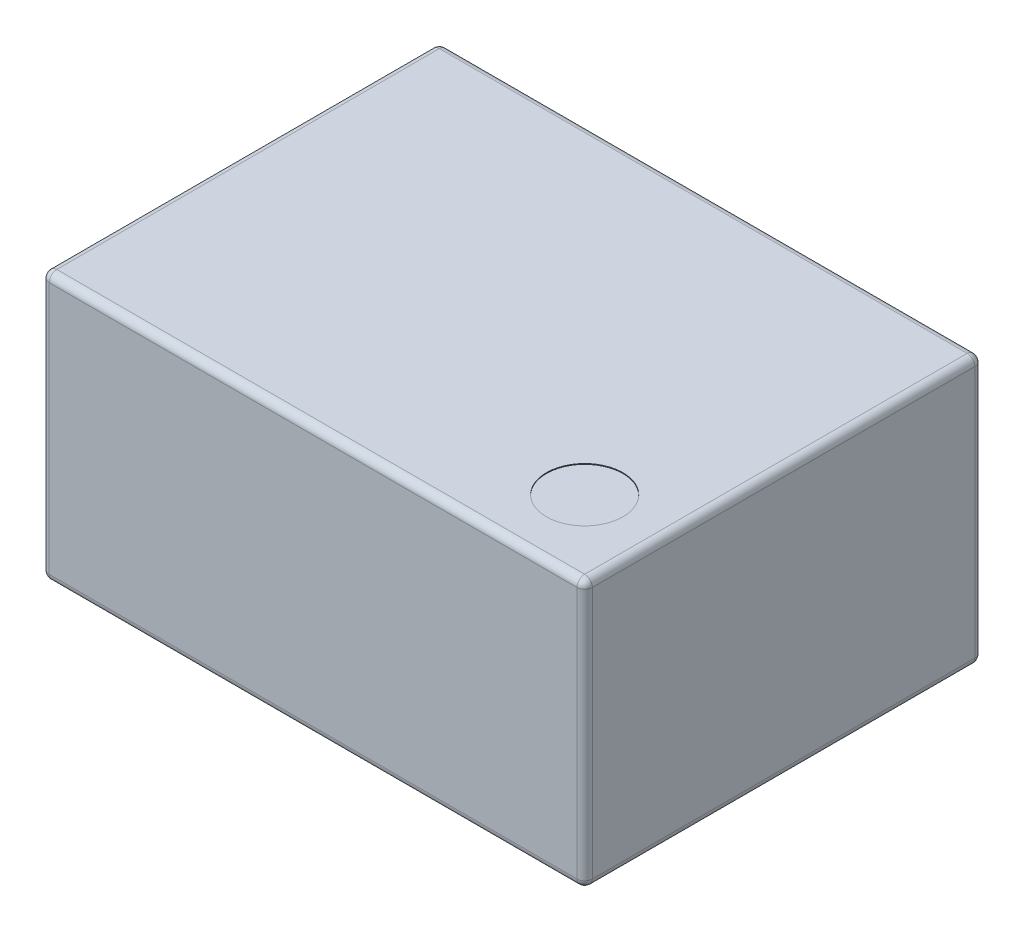
ISO-10303-21;
HEADER;
FILE_DESCRIPTION(('STEP AP214'),'2;1');
FILE_NAME('part.step','',(''),(''),'','','');
FILE_SCHEMA(('AUTOMOTIVE_DESIGN { 1 0 10303 214 1 1 1 1 }'));
ENDSEC;
DATA;
#1=APPLICATION_CONTEXT('core data for automotive mechanical design processes');
#2=APPLICATION_PROTOCOL_DEFINITION('international standard','automotive_design',2000,#1);
#3=PRODUCT_CONTEXT('',#1,'mechanical');
#4=PRODUCT('Part','Part','',(#3));
#5=PRODUCT_RELATED_PRODUCT_CATEGORY('part','',(#4));
#6=PRODUCT_DEFINITION_FORMATION('','',#4);
#7=PRODUCT_DEFINITION_CONTEXT('part definition',#1,'design');
#8=PRODUCT_DEFINITION('design','',#6,#7);
#9=PRODUCT_DEFINITION_SHAPE('','',#8);
#10=(LENGTH_UNIT() NAMED_UNIT(*) SI_UNIT(.MILLI.,.METRE.));
#11=(NAMED_UNIT(*) PLANE_ANGLE_UNIT() SI_UNIT($,.RADIAN.));
#12=(NAMED_UNIT(*) SI_UNIT($,.STERADIAN.) SOLID_ANGLE_UNIT());
#13=UNCERTAINTY_MEASURE_WITH_UNIT(LENGTH_MEASURE(1.E-05),#10,'distance_accuracy_value','');
#14=(GEOMETRIC_REPRESENTATION_CONTEXT(3) GLOBAL_UNCERTAINTY_ASSIGNED_CONTEXT((#13)) GLOBAL_UNIT_ASSIGNED_CONTEXT((#10,
#11,#12)) REPRESENTATION_CONTEXT('',''));
#15=CARTESIAN_POINT('',(0.,0.,0.));
#16=DIRECTION('',(0.,0.,1.));
#17=DIRECTION('',(1.,0.,0.));
#18=AXIS2_PLACEMENT_3D('',#15,#16,#17);
#19=CARTESIAN_POINT('',(3.55,3.5,-2.6));
#20=DIRECTION('',(-1.,0.,0.));
#21=DIRECTION('',(0.,0.,1.));
#22=AXIS2_PLACEMENT_3D('',#19,#20,#21);
#23=PLANE('',#22);
#24=DIRECTION('',(0.,-1.,0.));
#25=VECTOR('',#24,1.);
#26=CARTESIAN_POINT('',(3.55,3.5,2.5));
#27=LINE('',#26,#25);
#28=CARTESIAN_POINT('',(3.55,3.4,2.5));
#29=VERTEX_POINT('',#28);
#30=CARTESIAN_POINT('',(3.55,0.0999999999999998,2.5));
#31=VERTEX_POINT('',#30);
#32=EDGE_CURVE('E214',#29,#31,#27,.T.);
#33=ORIENTED_EDGE('',*,*,#32,.T.);
#34=DIRECTION('',(0.,0.,-1.));
#35=VECTOR('',#34,1.);
#36=CARTESIAN_POINT('',(3.55,0.0999999999999998,-2.6));
#37=LINE('',#36,#35);
#38=CARTESIAN_POINT('',(3.55,0.0999999999999998,-2.5));
#39=VERTEX_POINT('',#38);
#40=EDGE_CURVE('E223',#31,#39,#37,.T.);
#41=ORIENTED_EDGE('',*,*,#40,.T.);
#42=DIRECTION('',(0.,-1.,0.));
#43=VECTOR('',#42,1.);
#44=CARTESIAN_POINT('',(3.55,3.5,-2.5));
#45=LINE('',#44,#43);
#46=CARTESIAN_POINT('',(3.55,3.4,-2.5));
#47=VERTEX_POINT('',#46);
#48=EDGE_CURVE('E220',#39,#47,#45,.F.);
#49=ORIENTED_EDGE('',*,*,#48,.T.);
#50=DIRECTION('',(0.,0.,-1.));
#51=VECTOR('',#50,1.);
#52=CARTESIAN_POINT('',(3.55,3.4,2.6));
#53=LINE('',#52,#51);
#54=EDGE_CURVE('E217',#47,#29,#53,.F.);
#55=ORIENTED_EDGE('',*,*,#54,.T.);
#56=EDGE_LOOP('',(#33,#41,#49,#55));
#57=FACE_BOUND('',#56,.T.);
#58=ADVANCED_FACE('F40',(#57),#23,.F.);
#59=CARTESIAN_POINT('',(-3.55,3.5,-2.6));
#60=DIRECTION('',(0.,0.,1.));
#61=DIRECTION('',(1.,0.,0.));
#62=AXIS2_PLACEMENT_3D('',#59,#60,#61);
#63=PLANE('',#62);
#64=DIRECTION('',(0.,-1.,0.));
#65=VECTOR('',#64,1.);
#66=CARTESIAN_POINT('',(3.45,3.5,-2.6));
#67=LINE('',#66,#65);
#68=CARTESIAN_POINT('',(3.45,3.4,-2.6));
#69=VERTEX_POINT('',#68);
#70=CARTESIAN_POINT('',(3.45,0.0999999999999998,-2.6));
#71=VERTEX_POINT('',#70);
#72=EDGE_CURVE('E169',#69,#71,#67,.T.);
#73=ORIENTED_EDGE('',*,*,#72,.T.);
#74=DIRECTION('',(-1.,0.,0.));
#75=VECTOR('',#74,1.);
#76=CARTESIAN_POINT('',(-3.55,0.0999999999999998,-2.6));
#77=LINE('',#76,#75);
#78=CARTESIAN_POINT('',(-3.45,0.0999999999999998,-2.6));
#79=VERTEX_POINT('',#78);
#80=EDGE_CURVE('E138',#71,#79,#77,.T.);
#81=ORIENTED_EDGE('',*,*,#80,.T.);
#82=DIRECTION('',(0.,-1.,0.));
#83=VECTOR('',#82,1.);
#84=CARTESIAN_POINT('',(-3.45,3.5,-2.6));
#85=LINE('',#84,#83);
#86=CARTESIAN_POINT('',(-3.45,3.4,-2.6));
#87=VERTEX_POINT('',#86);
#88=EDGE_CURVE('E159',#79,#87,#85,.F.);
#89=ORIENTED_EDGE('',*,*,#88,.T.);
#90=DIRECTION('',(-1.,0.,0.));
#91=VECTOR('',#90,1.);
#92=CARTESIAN_POINT('',(3.55,3.4,-2.6));
#93=LINE('',#92,#91);
#94=EDGE_CURVE('E165',#87,#69,#93,.F.);
#95=ORIENTED_EDGE('',*,*,#94,.T.);
#96=EDGE_LOOP('',(#73,#81,#89,#95));
#97=FACE_BOUND('',#96,.T.);
#98=ADVANCED_FACE('F167',(#97),#63,.F.);
#99=CARTESIAN_POINT('',(-3.55,3.5,-2.6));
#100=DIRECTION('',(1.,0.,0.));
#101=DIRECTION('',(0.,0.,-1.));
#102=AXIS2_PLACEMENT_3D('',#99,#100,#101);
#103=PLANE('',#102);
#104=DIRECTION('',(0.,-1.,0.));
#105=VECTOR('',#104,1.);
#106=CARTESIAN_POINT('',(-3.55,3.5,-2.5));
#107=LINE('',#106,#105);
#108=CARTESIAN_POINT('',(-3.55,3.4,-2.5));
#109=VERTEX_POINT('',#108);
#110=CARTESIAN_POINT('',(-3.55,0.0999999999999998,-2.5));
#111=VERTEX_POINT('',#110);
#112=EDGE_CURVE('E191',#109,#111,#107,.T.);
#113=ORIENTED_EDGE('',*,*,#112,.T.);
#114=DIRECTION('',(0.,0.,1.));
#115=VECTOR('',#114,1.);
#116=CARTESIAN_POINT('',(-3.55,0.0999999999999998,-2.6));
#117=LINE('',#116,#115);
#118=CARTESIAN_POINT('',(-3.55,0.0999999999999998,2.5));
#119=VERTEX_POINT('',#118);
#120=EDGE_CURVE('E197',#111,#119,#117,.T.);
#121=ORIENTED_EDGE('',*,*,#120,.T.);
#122=DIRECTION('',(0.,-1.,0.));
#123=VECTOR('',#122,1.);
#124=CARTESIAN_POINT('',(-3.55,3.5,2.5));
#125=LINE('',#124,#123);
#126=CARTESIAN_POINT('',(-3.55,3.4,2.5));
#127=VERTEX_POINT('',#126);
#128=EDGE_CURVE('E194',#119,#127,#125,.F.);
#129=ORIENTED_EDGE('',*,*,#128,.T.);
#130=DIRECTION('',(0.,0.,1.));
#131=VECTOR('',#130,1.);
#132=CARTESIAN_POINT('',(-3.55,3.4,-2.6));
#133=LINE('',#132,#131);
#134=EDGE_CURVE('E188',#127,#109,#133,.F.);
#135=ORIENTED_EDGE('',*,*,#134,.T.);
#136=EDGE_LOOP('',(#113,#121,#129,#135));
#137=FACE_BOUND('',#136,.T.);
#138=ADVANCED_FACE('F382',(#137),#103,.F.);
#139=CARTESIAN_POINT('',(-3.55,3.5,2.6));
#140=DIRECTION('',(0.,0.,-1.));
#141=DIRECTION('',(-1.,0.,0.));
#142=AXIS2_PLACEMENT_3D('',#139,#140,#141);
#143=PLANE('',#142);
#144=DIRECTION('',(0.,-1.,0.));
#145=VECTOR('',#144,1.);
#146=CARTESIAN_POINT('',(-3.45,3.5,2.6));
#147=LINE('',#146,#145);
#148=CARTESIAN_POINT('',(-3.45,3.4,2.6));
#149=VERTEX_POINT('',#148);
#150=CARTESIAN_POINT('',(-3.45,0.0999999999999998,2.6));
#151=VERTEX_POINT('',#150);
#152=EDGE_CURVE('E204',#149,#151,#147,.T.);
#153=ORIENTED_EDGE('',*,*,#152,.T.);
#154=DIRECTION('',(1.,0.,0.));
#155=VECTOR('',#154,1.);
#156=CARTESIAN_POINT('',(-3.55,0.0999999999999998,2.6));
#157=LINE('',#156,#155);
#158=CARTESIAN_POINT('',(3.45,0.0999999999999998,2.6));
#159=VERTEX_POINT('',#158);
#160=EDGE_CURVE('E210',#151,#159,#157,.T.);
#161=ORIENTED_EDGE('',*,*,#160,.T.);
#162=DIRECTION('',(0.,-1.,0.));
#163=VECTOR('',#162,1.);
#164=CARTESIAN_POINT('',(3.45,3.5,2.6));
#165=LINE('',#164,#163);
#166=CARTESIAN_POINT('',(3.45,3.4,2.6));
#167=VERTEX_POINT('',#166);
#168=EDGE_CURVE('E207',#159,#167,#165,.F.);
#169=ORIENTED_EDGE('',*,*,#168,.T.);
#170=DIRECTION('',(1.,0.,0.));
#171=VECTOR('',#170,1.);
#172=CARTESIAN_POINT('',(-3.55,3.4,2.6));
#173=LINE('',#172,#171);
#174=EDGE_CURVE('E201',#167,#149,#173,.F.);
#175=ORIENTED_EDGE('',*,*,#174,.T.);
#176=EDGE_LOOP('',(#153,#161,#169,#175));
#177=FACE_BOUND('',#176,.T.);
#178=ADVANCED_FACE('F349',(#177),#143,.F.);
#179=CARTESIAN_POINT('',(0.,3.5,0.));
#180=DIRECTION('',(0.,1.,0.));
#181=DIRECTION('',(0.,0.,1.));
#182=AXIS2_PLACEMENT_3D('',#179,#180,#181);
#183=PLANE('',#182);
#184=CARTESIAN_POINT('',(2.55,3.5,1.6));
#185=DIRECTION('',(0.,1.,0.));
#186=DIRECTION('',(0.,0.,1.));
#187=AXIS2_PLACEMENT_3D('',#184,#185,#186);
#188=CIRCLE('',#187,0.5);
#189=CARTESIAN_POINT('',(2.55,3.5,2.1));
#190=VERTEX_POINT('',#189);
#191=EDGE_CURVE('E612',#190,#190,#188,.T.);
#192=ORIENTED_EDGE('',*,*,#191,.F.);
#193=EDGE_LOOP('',(#192));
#194=FACE_BOUND('',#193,.T.);
#195=DIRECTION('',(0.,0.,-1.));
#196=VECTOR('',#195,1.);
#197=CARTESIAN_POINT('',(3.45,3.5,-2.6));
#198=LINE('',#197,#196);
#199=CARTESIAN_POINT('',(3.45,3.5,2.5));
#200=VERTEX_POINT('',#199);
#201=CARTESIAN_POINT('',(3.45,3.5,-2.5));
#202=VERTEX_POINT('',#201);
#203=EDGE_CURVE('E50',#200,#202,#198,.T.);
#204=ORIENTED_EDGE('',*,*,#203,.T.);
#205=DIRECTION('',(-1.,0.,0.));
#206=VECTOR('',#205,1.);
#207=CARTESIAN_POINT('',(-3.55,3.5,-2.5));
#208=LINE('',#207,#206);
#209=CARTESIAN_POINT('',(-3.45,3.5,-2.5));
#210=VERTEX_POINT('',#209);
#211=EDGE_CURVE('E11',#202,#210,#208,.T.);
#212=ORIENTED_EDGE('',*,*,#211,.T.);
#213=DIRECTION('',(0.,0.,1.));
#214=VECTOR('',#213,1.);
#215=CARTESIAN_POINT('',(-3.45,3.5,2.6));
#216=LINE('',#215,#214);
#217=CARTESIAN_POINT('',(-3.45,3.5,2.5));
#218=VERTEX_POINT('',#217);
#219=EDGE_CURVE('E230',#210,#218,#216,.T.);
#220=ORIENTED_EDGE('',*,*,#219,.T.);
#221=DIRECTION('',(1.,0.,0.));
#222=VECTOR('',#221,1.);
#223=CARTESIAN_POINT('',(3.55,3.5,2.5));
#224=LINE('',#223,#222);
#225=EDGE_CURVE('E227',#218,#200,#224,.T.);
#226=ORIENTED_EDGE('',*,*,#225,.T.);
#227=EDGE_LOOP('',(#204,#212,#220,#226));
#228=FACE_BOUND('',#227,.T.);
#229=ADVANCED_FACE('F338',(#194,#228),#183,.T.);
#230=CARTESIAN_POINT('',(0.,0.,0.));
#231=DIRECTION('',(0.,1.,0.));
#232=DIRECTION('',(0.,0.,1.));
#233=AXIS2_PLACEMENT_3D('',#230,#231,#232);
#234=PLANE('',#233);
#235=DIRECTION('',(0.,0.,1.));
#236=VECTOR('',#235,1.);
#237=CARTESIAN_POINT('',(-3.45,0.,0.));
#238=LINE('',#237,#236);
#239=CARTESIAN_POINT('',(-3.45,0.,2.5));
#240=VERTEX_POINT('',#239);
#241=CARTESIAN_POINT('',(-3.45,0.,-2.5));
#242=VERTEX_POINT('',#241);
#243=EDGE_CURVE('E183',#240,#242,#238,.F.);
#244=ORIENTED_EDGE('',*,*,#243,.T.);
#245=DIRECTION('',(-1.,0.,0.));
#246=VECTOR('',#245,1.);
#247=CARTESIAN_POINT('',(0.,0.,-2.5));
#248=LINE('',#247,#246);
#249=CARTESIAN_POINT('',(3.45,0.,-2.5));
#250=VERTEX_POINT('',#249);
#251=EDGE_CURVE('E140',#242,#250,#248,.F.);
#252=ORIENTED_EDGE('',*,*,#251,.T.);
#253=DIRECTION('',(0.,0.,-1.));
#254=VECTOR('',#253,1.);
#255=CARTESIAN_POINT('',(3.45,0.,0.));
#256=LINE('',#255,#254);
#257=CARTESIAN_POINT('',(3.45,0.,2.5));
#258=VERTEX_POINT('',#257);
#259=EDGE_CURVE('E172',#250,#258,#256,.F.);
#260=ORIENTED_EDGE('',*,*,#259,.T.);
#261=DIRECTION('',(1.,0.,0.));
#262=VECTOR('',#261,1.);
#263=CARTESIAN_POINT('',(0.,0.,2.5));
#264=LINE('',#263,#262);
#265=EDGE_CURVE('E176',#258,#240,#264,.F.);
#266=ORIENTED_EDGE('',*,*,#265,.T.);
#267=EDGE_LOOP('',(#244,#252,#260,#266));
#268=FACE_BOUND('',#267,.T.);
#269=ADVANCED_FACE('F404',(#268),#234,.F.);
#270=CARTESIAN_POINT('',(0.,3.4,2.5));
#271=DIRECTION('',(-1.,0.,0.));
#272=DIRECTION('',(0.,0.,1.));
#273=AXIS2_PLACEMENT_3D('',#270,#271,#272);
#274=CYLINDRICAL_SURFACE('',#273,0.1);
#275=CARTESIAN_POINT('',(3.45,3.4,2.5));
#276=DIRECTION('',(1.,0.,0.));
#277=DIRECTION('',(0.,0.,-1.));
#278=AXIS2_PLACEMENT_3D('',#275,#276,#277);
#279=CIRCLE('',#278,0.1);
#280=EDGE_CURVE('E44',#200,#167,#279,.T.);
#281=ORIENTED_EDGE('',*,*,#280,.F.);
#282=ORIENTED_EDGE('',*,*,#225,.F.);
#283=CARTESIAN_POINT('',(-3.45,3.4,2.5));
#284=DIRECTION('',(-1.,0.,0.));
#285=DIRECTION('',(0.,0.,1.));
#286=AXIS2_PLACEMENT_3D('',#283,#284,#285);
#287=CIRCLE('',#286,0.1);
#288=EDGE_CURVE('E301',#149,#218,#287,.T.);
#289=ORIENTED_EDGE('',*,*,#288,.F.);
#290=ORIENTED_EDGE('',*,*,#174,.F.);
#291=EDGE_LOOP('',(#281,#282,#289,#290));
#292=FACE_BOUND('',#291,.T.);
#293=ADVANCED_FACE('F42',(#292),#274,.T.);
#294=CARTESIAN_POINT('',(3.45,3.4,2.5));
#295=DIRECTION('',(0.,0.,1.));
#296=DIRECTION('',(1.,0.,0.));
#297=AXIS2_PLACEMENT_3D('',#294,#295,#296);
#298=SPHERICAL_SURFACE('',#297,0.1);
#299=CARTESIAN_POINT('',(3.45,3.4,2.5));
#300=DIRECTION('',(0.,0.,1.));
#301=DIRECTION('',(0.,-1.,0.));
#302=AXIS2_PLACEMENT_3D('',#299,#300,#301);
#303=CIRCLE('',#302,0.1);
#304=EDGE_CURVE('E294',#200,#29,#303,.F.);
#305=ORIENTED_EDGE('',*,*,#304,.F.);
#306=ORIENTED_EDGE('',*,*,#280,.T.);
#307=CARTESIAN_POINT('',(3.45,3.4,2.5));
#308=DIRECTION('',(0.,1.,0.));
#309=DIRECTION('',(0.,0.,1.));
#310=AXIS2_PLACEMENT_3D('',#307,#308,#309);
#311=CIRCLE('',#310,0.1);
#312=EDGE_CURVE('E298',#29,#167,#311,.F.);
#313=ORIENTED_EDGE('',*,*,#312,.F.);
#314=EDGE_LOOP('',(#305,#306,#313));
#315=FACE_BOUND('',#314,.T.);
#316=ADVANCED_FACE('F314',(#315),#298,.T.);
#317=CARTESIAN_POINT('',(-3.45,3.4,2.5));
#318=DIRECTION('',(0.,0.,1.));
#319=DIRECTION('',(1.,0.,0.));
#320=AXIS2_PLACEMENT_3D('',#317,#318,#319);
#321=SPHERICAL_SURFACE('',#320,0.1);
#322=CARTESIAN_POINT('',(-3.45,3.4,2.5));
#323=DIRECTION('',(0.,1.,0.));
#324=DIRECTION('',(0.,0.,1.));
#325=AXIS2_PLACEMENT_3D('',#322,#323,#324);
#326=CIRCLE('',#325,0.1);
#327=EDGE_CURVE('E286',#149,#127,#326,.F.);
#328=ORIENTED_EDGE('',*,*,#327,.F.);
#329=ORIENTED_EDGE('',*,*,#288,.T.);
#330=CARTESIAN_POINT('',(-3.45,3.4,2.5));
#331=DIRECTION('',(0.,0.,1.));
#332=DIRECTION('',(1.,0.,0.));
#333=AXIS2_PLACEMENT_3D('',#330,#331,#332);
#334=CIRCLE('',#333,0.1);
#335=EDGE_CURVE('E290',#127,#218,#334,.F.);
#336=ORIENTED_EDGE('',*,*,#335,.F.);
#337=EDGE_LOOP('',(#328,#329,#336));
#338=FACE_BOUND('',#337,.T.);
#339=ADVANCED_FACE('F341',(#338),#321,.T.);
#340=CARTESIAN_POINT('',(3.45,3.5,2.5));
#341=DIRECTION('',(0.,-1.,0.));
#342=DIRECTION('',(0.,0.,-1.));
#343=AXIS2_PLACEMENT_3D('',#340,#341,#342);
#344=CYLINDRICAL_SURFACE('',#343,0.1);
#345=ORIENTED_EDGE('',*,*,#312,.T.);
#346=ORIENTED_EDGE('',*,*,#168,.F.);
#347=CARTESIAN_POINT('',(3.45,0.0999999999999998,2.5));
#348=DIRECTION('',(0.,-1.,0.));
#349=DIRECTION('',(0.,0.,-1.));
#350=AXIS2_PLACEMENT_3D('',#347,#348,#349);
#351=CIRCLE('',#350,0.1);
#352=EDGE_CURVE('E279',#31,#159,#351,.T.);
#353=ORIENTED_EDGE('',*,*,#352,.F.);
#354=ORIENTED_EDGE('',*,*,#32,.F.);
#355=EDGE_LOOP('',(#345,#346,#353,#354));
#356=FACE_BOUND('',#355,.T.);
#357=ADVANCED_FACE('F321',(#356),#344,.T.);
#358=CARTESIAN_POINT('',(3.45,3.4,0.));
#359=DIRECTION('',(0.,0.,1.));
#360=DIRECTION('',(1.,0.,0.));
#361=AXIS2_PLACEMENT_3D('',#358,#359,#360);
#362=CYLINDRICAL_SURFACE('',#361,0.1);
#363=ORIENTED_EDGE('',*,*,#304,.T.);
#364=ORIENTED_EDGE('',*,*,#54,.F.);
#365=CARTESIAN_POINT('',(3.45,3.4,-2.5));
#366=DIRECTION('',(0.,0.,-1.));
#367=DIRECTION('',(-1.,0.,0.));
#368=AXIS2_PLACEMENT_3D('',#365,#366,#367);
#369=CIRCLE('',#368,0.1);
#370=EDGE_CURVE('E275',#202,#47,#369,.T.);
#371=ORIENTED_EDGE('',*,*,#370,.F.);
#372=ORIENTED_EDGE('',*,*,#203,.F.);
#373=EDGE_LOOP('',(#363,#364,#371,#372));
#374=FACE_BOUND('',#373,.T.);
#375=ADVANCED_FACE('F330',(#374),#362,.T.);
#376=CARTESIAN_POINT('',(0.,3.4,-2.5));
#377=DIRECTION('',(1.,0.,0.));
#378=DIRECTION('',(0.,0.,-1.));
#379=AXIS2_PLACEMENT_3D('',#376,#377,#378);
#380=CYLINDRICAL_SURFACE('',#379,0.1);
#381=CARTESIAN_POINT('',(-3.45,3.4,-2.5));
#382=DIRECTION('',(-1.,0.,0.));
#383=DIRECTION('',(0.,0.,1.));
#384=AXIS2_PLACEMENT_3D('',#381,#382,#383);
#385=CIRCLE('',#384,0.1);
#386=EDGE_CURVE('E268',#210,#87,#385,.T.);
#387=ORIENTED_EDGE('',*,*,#386,.F.);
#388=ORIENTED_EDGE('',*,*,#211,.F.);
#389=CARTESIAN_POINT('',(3.45,3.4,-2.5));
#390=DIRECTION('',(1.,0.,0.));
#391=DIRECTION('',(0.,1.,0.));
#392=AXIS2_PLACEMENT_3D('',#389,#390,#391);
#393=CIRCLE('',#392,0.1);
#394=EDGE_CURVE('E271',#69,#202,#393,.T.);
#395=ORIENTED_EDGE('',*,*,#394,.F.);
#396=ORIENTED_EDGE('',*,*,#94,.F.);
#397=EDGE_LOOP('',(#387,#388,#395,#396));
#398=FACE_BOUND('',#397,.T.);
#399=ADVANCED_FACE('F336',(#398),#380,.T.);
#400=CARTESIAN_POINT('',(-3.45,3.4,0.));
#401=DIRECTION('',(0.,0.,-1.));
#402=DIRECTION('',(-1.,0.,0.));
#403=AXIS2_PLACEMENT_3D('',#400,#401,#402);
#404=CYLINDRICAL_SURFACE('',#403,0.1);
#405=ORIENTED_EDGE('',*,*,#335,.T.);
#406=ORIENTED_EDGE('',*,*,#219,.F.);
#407=CARTESIAN_POINT('',(-3.45,3.4,-2.5));
#408=DIRECTION('',(0.,0.,-1.));
#409=DIRECTION('',(-1.,0.,0.));
#410=AXIS2_PLACEMENT_3D('',#407,#408,#409);
#411=CIRCLE('',#410,0.1);
#412=EDGE_CURVE('E64',#109,#210,#411,.T.);
#413=ORIENTED_EDGE('',*,*,#412,.F.);
#414=ORIENTED_EDGE('',*,*,#134,.F.);
#415=EDGE_LOOP('',(#405,#406,#413,#414));
#416=FACE_BOUND('',#415,.T.);
#417=ADVANCED_FACE('F437',(#416),#404,.T.);
#418=CARTESIAN_POINT('',(-3.45,3.5,2.5));
#419=DIRECTION('',(0.,-1.,0.));
#420=DIRECTION('',(0.,0.,-1.));
#421=AXIS2_PLACEMENT_3D('',#418,#419,#420);
#422=CYLINDRICAL_SURFACE('',#421,0.1);
#423=ORIENTED_EDGE('',*,*,#327,.T.);
#424=ORIENTED_EDGE('',*,*,#128,.F.);
#425=CARTESIAN_POINT('',(-3.45,0.0999999999999998,2.5));
#426=DIRECTION('',(0.,-1.,0.));
#427=DIRECTION('',(0.,0.,-1.));
#428=AXIS2_PLACEMENT_3D('',#425,#426,#427);
#429=CIRCLE('',#428,0.1);
#430=EDGE_CURVE('E262',#151,#119,#429,.T.);
#431=ORIENTED_EDGE('',*,*,#430,.F.);
#432=ORIENTED_EDGE('',*,*,#152,.F.);
#433=EDGE_LOOP('',(#423,#424,#431,#432));
#434=FACE_BOUND('',#433,.T.);
#435=ADVANCED_FACE('F346',(#434),#422,.T.);
#436=CARTESIAN_POINT('',(-3.55,0.0999999999999998,2.5));
#437=DIRECTION('',(1.,0.,0.));
#438=DIRECTION('',(0.,0.,-1.));
#439=AXIS2_PLACEMENT_3D('',#436,#437,#438);
#440=CYLINDRICAL_SURFACE('',#439,0.1);
#441=CARTESIAN_POINT('',(3.45,0.0999999999999998,2.5));
#442=DIRECTION('',(1.,0.,0.));
#443=DIRECTION('',(0.,0.,-1.));
#444=AXIS2_PLACEMENT_3D('',#441,#442,#443);
#445=CIRCLE('',#444,0.1);
#446=EDGE_CURVE('E282',#159,#258,#445,.T.);
#447=ORIENTED_EDGE('',*,*,#446,.F.);
#448=ORIENTED_EDGE('',*,*,#160,.F.);
#449=CARTESIAN_POINT('',(-3.45,0.1,2.5));
#450=DIRECTION('',(-1.,0.,0.));
#451=DIRECTION('',(0.,0.,1.));
#452=AXIS2_PLACEMENT_3D('',#449,#450,#451);
#453=CIRCLE('',#452,0.1);
#454=EDGE_CURVE('E258',#240,#151,#453,.T.);
#455=ORIENTED_EDGE('',*,*,#454,.F.);
#456=ORIENTED_EDGE('',*,*,#265,.F.);
#457=EDGE_LOOP('',(#447,#448,#455,#456));
#458=FACE_BOUND('',#457,.T.);
#459=ADVANCED_FACE('F353',(#458),#440,.T.);
#460=CARTESIAN_POINT('',(3.45,0.1,2.5));
#461=DIRECTION('',(0.,0.,1.));
#462=DIRECTION('',(1.,0.,0.));
#463=AXIS2_PLACEMENT_3D('',#460,#461,#462);
#464=SPHERICAL_SURFACE('',#463,0.1);
#465=ORIENTED_EDGE('',*,*,#352,.T.);
#466=ORIENTED_EDGE('',*,*,#446,.T.);
#467=CARTESIAN_POINT('',(3.45,0.1,2.5));
#468=DIRECTION('',(0.,0.,1.));
#469=DIRECTION('',(1.,0.,0.));
#470=AXIS2_PLACEMENT_3D('',#467,#468,#469);
#471=CIRCLE('',#470,0.1);
#472=EDGE_CURVE('E254',#31,#258,#471,.F.);
#473=ORIENTED_EDGE('',*,*,#472,.F.);
#474=EDGE_LOOP('',(#465,#466,#473));
#475=FACE_BOUND('',#474,.T.);
#476=ADVANCED_FACE('F357',(#475),#464,.T.);
#477=CARTESIAN_POINT('',(3.45,3.4,-2.5));
#478=DIRECTION('',(0.,0.,1.));
#479=DIRECTION('',(1.,0.,0.));
#480=AXIS2_PLACEMENT_3D('',#477,#478,#479);
#481=SPHERICAL_SURFACE('',#480,0.1);
#482=ORIENTED_EDGE('',*,*,#394,.T.);
#483=ORIENTED_EDGE('',*,*,#370,.T.);
#484=CARTESIAN_POINT('',(3.45,3.4,-2.5));
#485=DIRECTION('',(0.,1.,0.));
#486=DIRECTION('',(0.,0.,1.));
#487=AXIS2_PLACEMENT_3D('',#484,#485,#486);
#488=CIRCLE('',#487,0.1);
#489=EDGE_CURVE('E250',#69,#47,#488,.F.);
#490=ORIENTED_EDGE('',*,*,#489,.F.);
#491=EDGE_LOOP('',(#482,#483,#490));
#492=FACE_BOUND('',#491,.T.);
#493=ADVANCED_FACE('F334',(#492),#481,.T.);
#494=CARTESIAN_POINT('',(-3.45,3.4,-2.5));
#495=DIRECTION('',(0.,0.,1.));
#496=DIRECTION('',(1.,0.,0.));
#497=AXIS2_PLACEMENT_3D('',#494,#495,#496);
#498=SPHERICAL_SURFACE('',#497,0.1);
#499=ORIENTED_EDGE('',*,*,#412,.T.);
#500=ORIENTED_EDGE('',*,*,#386,.T.);
#501=CARTESIAN_POINT('',(-3.45,3.4,-2.5));
#502=DIRECTION('',(0.,1.,0.));
#503=DIRECTION('',(0.,0.,1.));
#504=AXIS2_PLACEMENT_3D('',#501,#502,#503);
#505=CIRCLE('',#504,0.1);
#506=EDGE_CURVE('E161',#109,#87,#505,.F.);
#507=ORIENTED_EDGE('',*,*,#506,.F.);
#508=EDGE_LOOP('',(#499,#500,#507));
#509=FACE_BOUND('',#508,.T.);
#510=ADVANCED_FACE('F419',(#509),#498,.T.);
#511=CARTESIAN_POINT('',(-3.45,0.1,2.5));
#512=DIRECTION('',(0.,0.,1.));
#513=DIRECTION('',(1.,0.,0.));
#514=AXIS2_PLACEMENT_3D('',#511,#512,#513);
#515=SPHERICAL_SURFACE('',#514,0.1);
#516=ORIENTED_EDGE('',*,*,#454,.T.);
#517=ORIENTED_EDGE('',*,*,#430,.T.);
#518=CARTESIAN_POINT('',(-3.45,0.0999999999999998,2.5));
#519=DIRECTION('',(0.,0.,1.));
#520=DIRECTION('',(1.,0.,0.));
#521=AXIS2_PLACEMENT_3D('',#518,#519,#520);
#522=CIRCLE('',#521,0.1);
#523=EDGE_CURVE('E245',#240,#119,#522,.F.);
#524=ORIENTED_EDGE('',*,*,#523,.F.);
#525=EDGE_LOOP('',(#516,#517,#524));
#526=FACE_BOUND('',#525,.T.);
#527=ADVANCED_FACE('F417',(#526),#515,.T.);
#528=CARTESIAN_POINT('',(3.45,0.0999999999999998,-2.6));
#529=DIRECTION('',(0.,0.,-1.));
#530=DIRECTION('',(-1.,0.,0.));
#531=AXIS2_PLACEMENT_3D('',#528,#529,#530);
#532=CYLINDRICAL_SURFACE('',#531,0.1);
#533=ORIENTED_EDGE('',*,*,#472,.T.);
#534=ORIENTED_EDGE('',*,*,#259,.F.);
#535=CARTESIAN_POINT('',(3.45,0.0999999999999998,-2.5));
#536=DIRECTION('',(0.,0.,-1.));
#537=DIRECTION('',(-1.,0.,0.));
#538=AXIS2_PLACEMENT_3D('',#535,#536,#537);
#539=CIRCLE('',#538,0.1);
#540=EDGE_CURVE('E241',#39,#250,#539,.T.);
#541=ORIENTED_EDGE('',*,*,#540,.F.);
#542=ORIENTED_EDGE('',*,*,#40,.F.);
#543=EDGE_LOOP('',(#533,#534,#541,#542));
#544=FACE_BOUND('',#543,.T.);
#545=ADVANCED_FACE('F360',(#544),#532,.T.);
#546=CARTESIAN_POINT('',(3.45,3.5,-2.5));
#547=DIRECTION('',(0.,-1.,0.));
#548=DIRECTION('',(0.,0.,-1.));
#549=AXIS2_PLACEMENT_3D('',#546,#547,#548);
#550=CYLINDRICAL_SURFACE('',#549,0.1);
#551=ORIENTED_EDGE('',*,*,#489,.T.);
#552=ORIENTED_EDGE('',*,*,#48,.F.);
#553=CARTESIAN_POINT('',(3.45,0.0999999999999998,-2.5));
#554=DIRECTION('',(0.,-1.,0.));
#555=DIRECTION('',(0.,0.,-1.));
#556=AXIS2_PLACEMENT_3D('',#553,#554,#555);
#557=CIRCLE('',#556,0.1);
#558=EDGE_CURVE('E156',#71,#39,#557,.T.);
#559=ORIENTED_EDGE('',*,*,#558,.F.);
#560=ORIENTED_EDGE('',*,*,#72,.F.);
#561=EDGE_LOOP('',(#551,#552,#559,#560));
#562=FACE_BOUND('',#561,.T.);
#563=ADVANCED_FACE('F365',(#562),#550,.T.);
#564=CARTESIAN_POINT('',(-3.45,3.5,-2.5));
#565=DIRECTION('',(0.,-1.,0.));
#566=DIRECTION('',(0.,0.,-1.));
#567=AXIS2_PLACEMENT_3D('',#564,#565,#566);
#568=CYLINDRICAL_SURFACE('',#567,0.1);
#569=ORIENTED_EDGE('',*,*,#506,.T.);
#570=ORIENTED_EDGE('',*,*,#88,.F.);
#571=CARTESIAN_POINT('',(-3.45,0.0999999999999998,-2.5));
#572=DIRECTION('',(0.,-1.,0.));
#573=DIRECTION('',(0.,0.,-1.));
#574=AXIS2_PLACEMENT_3D('',#571,#572,#573);
#575=CIRCLE('',#574,0.1);
#576=EDGE_CURVE('E148',#111,#79,#575,.T.);
#577=ORIENTED_EDGE('',*,*,#576,.F.);
#578=ORIENTED_EDGE('',*,*,#112,.F.);
#579=EDGE_LOOP('',(#569,#570,#577,#578));
#580=FACE_BOUND('',#579,.T.);
#581=ADVANCED_FACE('F160',(#580),#568,.T.);
#582=CARTESIAN_POINT('',(-3.45,0.0999999999999998,-2.6));
#583=DIRECTION('',(0.,0.,1.));
#584=DIRECTION('',(1.,0.,0.));
#585=AXIS2_PLACEMENT_3D('',#582,#583,#584);
#586=CYLINDRICAL_SURFACE('',#585,0.1);
#587=ORIENTED_EDGE('',*,*,#523,.T.);
#588=ORIENTED_EDGE('',*,*,#120,.F.);
#589=CARTESIAN_POINT('',(-3.45,0.1,-2.5));
#590=DIRECTION('',(0.,0.,-1.));
#591=DIRECTION('',(-1.,0.,0.));
#592=AXIS2_PLACEMENT_3D('',#589,#590,#591);
#593=CIRCLE('',#592,0.1);
#594=EDGE_CURVE('E152',#242,#111,#593,.T.);
#595=ORIENTED_EDGE('',*,*,#594,.F.);
#596=ORIENTED_EDGE('',*,*,#243,.F.);
#597=EDGE_LOOP('',(#587,#588,#595,#596));
#598=FACE_BOUND('',#597,.T.);
#599=ADVANCED_FACE('F368',(#598),#586,.T.);
#600=CARTESIAN_POINT('',(3.45,0.1,-2.5));
#601=DIRECTION('',(0.,0.,1.));
#602=DIRECTION('',(1.,0.,0.));
#603=AXIS2_PLACEMENT_3D('',#600,#601,#602);
#604=SPHERICAL_SURFACE('',#603,0.1);
#605=ORIENTED_EDGE('',*,*,#558,.T.);
#606=ORIENTED_EDGE('',*,*,#540,.T.);
#607=CARTESIAN_POINT('',(3.45,0.1,-2.5));
#608=DIRECTION('',(1.,0.,0.));
#609=DIRECTION('',(0.,0.,-1.));
#610=AXIS2_PLACEMENT_3D('',#607,#608,#609);
#611=CIRCLE('',#610,0.1);
#612=EDGE_CURVE('E144',#71,#250,#611,.F.);
#613=ORIENTED_EDGE('',*,*,#612,.F.);
#614=EDGE_LOOP('',(#605,#606,#613));
#615=FACE_BOUND('',#614,.T.);
#616=ADVANCED_FACE('F366',(#615),#604,.T.);
#617=CARTESIAN_POINT('',(-3.45,0.1,-2.5));
#618=DIRECTION('',(0.,0.,1.));
#619=DIRECTION('',(1.,0.,0.));
#620=AXIS2_PLACEMENT_3D('',#617,#618,#619);
#621=SPHERICAL_SURFACE('',#620,0.1);
#622=ORIENTED_EDGE('',*,*,#594,.T.);
#623=ORIENTED_EDGE('',*,*,#576,.T.);
#624=CARTESIAN_POINT('',(-3.45,0.0999999999999998,-2.5));
#625=DIRECTION('',(-1.,0.,0.));
#626=DIRECTION('',(0.,0.,1.));
#627=AXIS2_PLACEMENT_3D('',#624,#625,#626);
#628=CIRCLE('',#627,0.1);
#629=EDGE_CURVE('E134',#242,#79,#628,.F.);
#630=ORIENTED_EDGE('',*,*,#629,.F.);
#631=EDGE_LOOP('',(#622,#623,#630));
#632=FACE_BOUND('',#631,.T.);
#633=ADVANCED_FACE('F150',(#632),#621,.T.);
#634=CARTESIAN_POINT('',(-3.55,0.0999999999999998,-2.5));
#635=DIRECTION('',(-1.,0.,0.));
#636=DIRECTION('',(0.,0.,1.));
#637=AXIS2_PLACEMENT_3D('',#634,#635,#636);
#638=CYLINDRICAL_SURFACE('',#637,0.1);
#639=ORIENTED_EDGE('',*,*,#612,.T.);
#640=ORIENTED_EDGE('',*,*,#251,.F.);
#641=ORIENTED_EDGE('',*,*,#629,.T.);
#642=ORIENTED_EDGE('',*,*,#80,.F.);
#643=EDGE_LOOP('',(#639,#640,#641,#642));
#644=FACE_BOUND('',#643,.T.);
#645=ADVANCED_FACE('F136',(#644),#638,.T.);
#646=CARTESIAN_POINT('',(2.55,3.49,1.6));
#647=DIRECTION('',(0.,1.,0.));
#648=DIRECTION('',(0.,0.,1.));
#649=AXIS2_PLACEMENT_3D('',#646,#647,#648);
#650=CYLINDRICAL_SURFACE('',#649,0.5);
#651=CARTESIAN_POINT('',(2.55,3.49,1.6));
#652=DIRECTION('',(0.,1.,0.));
#653=DIRECTION('',(0.,0.,1.));
#654=AXIS2_PLACEMENT_3D('',#651,#652,#653);
#655=CIRCLE('',#654,0.5);
#656=CARTESIAN_POINT('',(2.55,3.49,2.1));
#657=VERTEX_POINT('',#656);
#658=EDGE_CURVE('E145',#657,#657,#655,.T.);
#659=ORIENTED_EDGE('',*,*,#658,.F.);
#660=EDGE_LOOP('',(#659));
#661=FACE_BOUND('',#660,.T.);
#662=ORIENTED_EDGE('',*,*,#191,.T.);
#663=EDGE_LOOP('',(#662));
#664=FACE_BOUND('',#663,.T.);
#665=ADVANCED_FACE('F387',(#661,#664),#650,.F.);
#666=CARTESIAN_POINT('',(2.55,3.49,1.6));
#667=DIRECTION('',(0.,1.,0.));
#668=DIRECTION('',(0.,0.,1.));
#669=AXIS2_PLACEMENT_3D('',#666,#667,#668);
#670=PLANE('',#669);
#671=ORIENTED_EDGE('',*,*,#658,.T.);
#672=EDGE_LOOP('',(#671));
#673=FACE_BOUND('',#672,.T.);
#674=ADVANCED_FACE('F391',(#673),#670,.T.);
#675=CLOSED_SHELL('',(#58,#98,#138,#178,#229,#269,#293,#316,#339,#357,#375,#399,#417,#435,#459,
#476,#493,#510,#527,#545,#563,#581,#599,#616,#633,#645,#665,#674));
#676=MANIFOLD_SOLID_BREP('B2',#675);
#677=ADVANCED_BREP_SHAPE_REPRESENTATION('',(#18,#676),#14);
#678=SHAPE_DEFINITION_REPRESENTATION(#9,#677);
ENDSEC;
END-ISO-10303-21;
